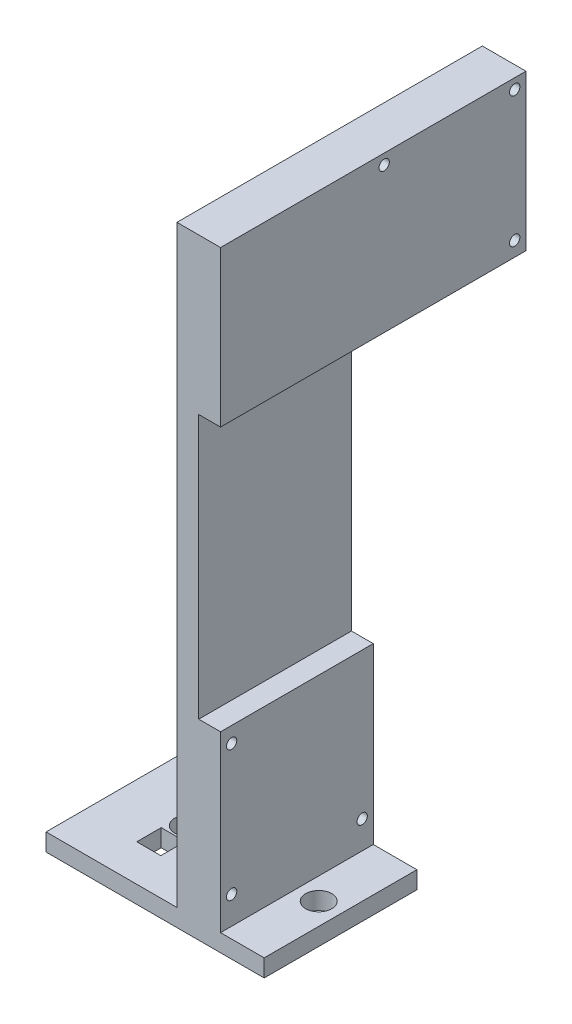
ISO-10303-21;
HEADER;
FILE_DESCRIPTION(('STEP AP214'),'2;1');
FILE_NAME('part.step','',(''),(''),'','','');
FILE_SCHEMA(('AUTOMOTIVE_DESIGN { 1 0 10303 214 1 1 1 1 }'));
ENDSEC;
DATA;
#1=APPLICATION_CONTEXT('core data for automotive mechanical design processes');
#2=APPLICATION_PROTOCOL_DEFINITION('international standard','automotive_design',2000,#1);
#3=PRODUCT_CONTEXT('',#1,'mechanical');
#4=PRODUCT('Part','Part','',(#3));
#5=PRODUCT_RELATED_PRODUCT_CATEGORY('part','',(#4));
#6=PRODUCT_DEFINITION_FORMATION('','',#4);
#7=PRODUCT_DEFINITION_CONTEXT('part definition',#1,'design');
#8=PRODUCT_DEFINITION('design','',#6,#7);
#9=PRODUCT_DEFINITION_SHAPE('','',#8);
#10=(LENGTH_UNIT() NAMED_UNIT(*) SI_UNIT(.MILLI.,.METRE.));
#11=(NAMED_UNIT(*) PLANE_ANGLE_UNIT() SI_UNIT($,.RADIAN.));
#12=(NAMED_UNIT(*) SI_UNIT($,.STERADIAN.) SOLID_ANGLE_UNIT());
#13=UNCERTAINTY_MEASURE_WITH_UNIT(LENGTH_MEASURE(1.E-05),#10,'distance_accuracy_value','');
#14=(GEOMETRIC_REPRESENTATION_CONTEXT(3) GLOBAL_UNCERTAINTY_ASSIGNED_CONTEXT((#13)) GLOBAL_UNIT_ASSIGNED_CONTEXT((#10,
#11,#12)) REPRESENTATION_CONTEXT('',''));
#15=CARTESIAN_POINT('',(0.,0.,0.));
#16=DIRECTION('',(0.,0.,1.));
#17=DIRECTION('',(1.,0.,0.));
#18=AXIS2_PLACEMENT_3D('',#15,#16,#17);
#19=CARTESIAN_POINT('',(6.35,172.72,22.225));
#20=DIRECTION('',(-1.,0.,0.));
#21=DIRECTION('',(0.,0.,1.));
#22=AXIS2_PLACEMENT_3D('',#19,#20,#21);
#23=PLANE('',#22);
#24=CARTESIAN_POINT('',(6.35,131.72,-63.4));
#25=DIRECTION('',(1.,0.,0.));
#26=DIRECTION('',(0.,0.,-1.));
#27=AXIS2_PLACEMENT_3D('',#24,#25,#26);
#28=CIRCLE('',#27,1.5);
#29=CARTESIAN_POINT('',(6.35,131.72,-64.9));
#30=VERTEX_POINT('',#29);
#31=EDGE_CURVE('E188',#30,#30,#28,.T.);
#32=ORIENTED_EDGE('',*,*,#31,.F.);
#33=EDGE_LOOP('',(#32));
#34=FACE_BOUND('',#33,.T.);
#35=CARTESIAN_POINT('',(6.35,169.72,-63.4));
#36=DIRECTION('',(1.,0.,0.));
#37=DIRECTION('',(0.,0.,-1.));
#38=AXIS2_PLACEMENT_3D('',#35,#36,#37);
#39=CIRCLE('',#38,1.5);
#40=CARTESIAN_POINT('',(6.35,169.72,-64.9));
#41=VERTEX_POINT('',#40);
#42=EDGE_CURVE('E185',#41,#41,#39,.T.);
#43=ORIENTED_EDGE('',*,*,#42,.F.);
#44=EDGE_LOOP('',(#43));
#45=FACE_BOUND('',#44,.T.);
#46=CARTESIAN_POINT('',(6.35,169.72,-25.4));
#47=DIRECTION('',(1.,0.,0.));
#48=DIRECTION('',(0.,0.,-1.));
#49=AXIS2_PLACEMENT_3D('',#46,#47,#48);
#50=CIRCLE('',#49,1.5);
#51=CARTESIAN_POINT('',(6.35,169.72,-26.9));
#52=VERTEX_POINT('',#51);
#53=EDGE_CURVE('E181',#52,#52,#50,.T.);
#54=ORIENTED_EDGE('',*,*,#53,.F.);
#55=EDGE_LOOP('',(#54));
#56=FACE_BOUND('',#55,.T.);
#57=DIRECTION('',(0.,-1.,0.));
#58=VECTOR('',#57,1.);
#59=CARTESIAN_POINT('',(6.35,172.72,22.225));
#60=LINE('',#59,#58);
#61=CARTESIAN_POINT('',(6.35,172.72,22.225));
#62=VERTEX_POINT('',#61);
#63=CARTESIAN_POINT('',(6.35,127.453317587513,22.225));
#64=VERTEX_POINT('',#63);
#65=EDGE_CURVE('E314',#62,#64,#60,.T.);
#66=ORIENTED_EDGE('',*,*,#65,.T.);
#67=DIRECTION('',(0.,0.,1.));
#68=VECTOR('',#67,1.);
#69=CARTESIAN_POINT('',(6.35,127.453317587513,-66.675));
#70=LINE('',#69,#68);
#71=CARTESIAN_POINT('',(6.35,127.453317587513,-66.675));
#72=VERTEX_POINT('',#71);
#73=EDGE_CURVE('E207',#72,#64,#70,.T.);
#74=ORIENTED_EDGE('',*,*,#73,.F.);
#75=DIRECTION('',(0.,-1.,0.));
#76=VECTOR('',#75,1.);
#77=CARTESIAN_POINT('',(6.35,127.453317587513,-66.675));
#78=LINE('',#77,#76);
#79=CARTESIAN_POINT('',(6.35,172.72,-66.675));
#80=VERTEX_POINT('',#79);
#81=EDGE_CURVE('E191',#80,#72,#78,.T.);
#82=ORIENTED_EDGE('',*,*,#81,.F.);
#83=DIRECTION('',(0.,0.,-1.));
#84=VECTOR('',#83,1.);
#85=CARTESIAN_POINT('',(6.35,172.72,22.225));
#86=LINE('',#85,#84);
#87=EDGE_CURVE('E303',#62,#80,#86,.T.);
#88=ORIENTED_EDGE('',*,*,#87,.F.);
#89=EDGE_LOOP('',(#66,#74,#82,#88));
#90=FACE_BOUND('',#89,.T.);
#91=ADVANCED_FACE('F33',(#34,#45,#56,#90),#23,.F.);
#92=CARTESIAN_POINT('',(-6.35,172.72,-22.225));
#93=DIRECTION('',(0.,0.,1.));
#94=DIRECTION('',(1.,0.,0.));
#95=AXIS2_PLACEMENT_3D('',#92,#93,#94);
#96=PLANE('',#95);
#97=DIRECTION('',(0.,1.,0.));
#98=VECTOR('',#97,1.);
#99=CARTESIAN_POINT('',(0.,50.6407677589493,-22.225));
#100=LINE('',#99,#98);
#101=CARTESIAN_POINT('',(0.,50.6407677589493,-22.225));
#102=VERTEX_POINT('',#101);
#103=CARTESIAN_POINT('',(0.,127.453317587513,-22.225));
#104=VERTEX_POINT('',#103);
#105=EDGE_CURVE('E162',#102,#104,#100,.T.);
#106=ORIENTED_EDGE('',*,*,#105,.F.);
#107=DIRECTION('',(1.,0.,0.));
#108=VECTOR('',#107,1.);
#109=CARTESIAN_POINT('',(0.,50.6407677589493,-22.225));
#110=LINE('',#109,#108);
#111=CARTESIAN_POINT('',(6.35,50.6407677589493,-22.225));
#112=VERTEX_POINT('',#111);
#113=EDGE_CURVE('E159',#102,#112,#110,.T.);
#114=ORIENTED_EDGE('',*,*,#113,.T.);
#115=DIRECTION('',(0.,-1.,0.));
#116=VECTOR('',#115,1.);
#117=CARTESIAN_POINT('',(6.35,172.72,-22.225));
#118=LINE('',#117,#116);
#119=CARTESIAN_POINT('',(6.35,0.,-22.225));
#120=VERTEX_POINT('',#119);
#121=EDGE_CURVE('E11',#112,#120,#118,.T.);
#122=ORIENTED_EDGE('',*,*,#121,.T.);
#123=DIRECTION('',(1.,0.,0.));
#124=VECTOR('',#123,1.);
#125=CARTESIAN_POINT('',(-44.45,0.,-22.225));
#126=LINE('',#125,#124);
#127=CARTESIAN_POINT('',(19.05,0.,-22.225));
#128=VERTEX_POINT('',#127);
#129=EDGE_CURVE('E265',#120,#128,#126,.T.);
#130=ORIENTED_EDGE('',*,*,#129,.T.);
#131=DIRECTION('',(0.,1.,0.));
#132=VECTOR('',#131,1.);
#133=CARTESIAN_POINT('',(19.05,-5.08,-22.225));
#134=LINE('',#133,#132);
#135=CARTESIAN_POINT('',(19.05,-5.08,-22.225));
#136=VERTEX_POINT('',#135);
#137=EDGE_CURVE('E278',#136,#128,#134,.T.);
#138=ORIENTED_EDGE('',*,*,#137,.F.);
#139=DIRECTION('',(1.,0.,0.));
#140=VECTOR('',#139,1.);
#141=CARTESIAN_POINT('',(-44.45,-5.08,-22.225));
#142=LINE('',#141,#140);
#143=CARTESIAN_POINT('',(-44.45,-5.08,-22.225));
#144=VERTEX_POINT('',#143);
#145=EDGE_CURVE('E255',#144,#136,#142,.T.);
#146=ORIENTED_EDGE('',*,*,#145,.F.);
#147=DIRECTION('',(0.,1.,0.));
#148=VECTOR('',#147,1.);
#149=CARTESIAN_POINT('',(-44.45,-5.08,-22.225));
#150=LINE('',#149,#148);
#151=CARTESIAN_POINT('',(-44.45,0.,-22.225));
#152=VERTEX_POINT('',#151);
#153=EDGE_CURVE('E281',#144,#152,#150,.T.);
#154=ORIENTED_EDGE('',*,*,#153,.T.);
#155=CARTESIAN_POINT('',(-6.34999999999999,0.,-22.225));
#156=VERTEX_POINT('',#155);
#157=EDGE_CURVE('E266',#152,#156,#126,.T.);
#158=ORIENTED_EDGE('',*,*,#157,.T.);
#159=DIRECTION('',(0.,-1.,0.));
#160=VECTOR('',#159,1.);
#161=CARTESIAN_POINT('',(-6.35,172.72,-22.225));
#162=LINE('',#161,#160);
#163=CARTESIAN_POINT('',(-6.35,127.453317587513,-22.225));
#164=VERTEX_POINT('',#163);
#165=EDGE_CURVE('E42',#164,#156,#162,.T.);
#166=ORIENTED_EDGE('',*,*,#165,.F.);
#167=DIRECTION('',(-1.,0.,0.));
#168=VECTOR('',#167,1.);
#169=CARTESIAN_POINT('',(6.35,127.453317587513,-22.225));
#170=LINE('',#169,#168);
#171=EDGE_CURVE('E195',#104,#164,#170,.T.);
#172=ORIENTED_EDGE('',*,*,#171,.F.);
#173=EDGE_LOOP('',(#106,#114,#122,#130,#138,#146,#154,#158,#166,#172));
#174=FACE_BOUND('',#173,.T.);
#175=ADVANCED_FACE('F346',(#174),#96,.F.);
#176=CARTESIAN_POINT('',(6.35,46.079994,19.0000001));
#177=DIRECTION('',(1.,0.,0.));
#178=DIRECTION('',(0.,0.,-1.));
#179=AXIS2_PLACEMENT_3D('',#176,#177,#178);
#180=CIRCLE('',#179,1.5);
#181=CARTESIAN_POINT('',(6.35,46.079994,17.5000001));
#182=VERTEX_POINT('',#181);
#183=EDGE_CURVE('E284',#182,#182,#180,.T.);
#184=ORIENTED_EDGE('',*,*,#183,.F.);
#185=EDGE_LOOP('',(#184));
#186=FACE_BOUND('',#185,.T.);
#187=CARTESIAN_POINT('',(6.35,8.079994,-19.));
#188=DIRECTION('',(1.,0.,0.));
#189=DIRECTION('',(0.,0.,-1.));
#190=AXIS2_PLACEMENT_3D('',#187,#188,#189);
#191=CIRCLE('',#190,1.5);
#192=CARTESIAN_POINT('',(6.35,8.079994,-20.5));
#193=VERTEX_POINT('',#192);
#194=EDGE_CURVE('E289',#193,#193,#191,.T.);
#195=ORIENTED_EDGE('',*,*,#194,.F.);
#196=EDGE_LOOP('',(#195));
#197=FACE_BOUND('',#196,.T.);
#198=CARTESIAN_POINT('',(6.35,8.079994,19.0000001));
#199=DIRECTION('',(1.,0.,0.));
#200=DIRECTION('',(0.,0.,-1.));
#201=AXIS2_PLACEMENT_3D('',#198,#199,#200);
#202=CIRCLE('',#201,1.5);
#203=CARTESIAN_POINT('',(6.35,8.079994,17.5000001));
#204=VERTEX_POINT('',#203);
#205=EDGE_CURVE('E288',#204,#204,#202,.T.);
#206=ORIENTED_EDGE('',*,*,#205,.F.);
#207=EDGE_LOOP('',(#206));
#208=FACE_BOUND('',#207,.T.);
#209=ORIENTED_EDGE('',*,*,#121,.F.);
#210=DIRECTION('',(0.,0.,-1.));
#211=VECTOR('',#210,1.);
#212=CARTESIAN_POINT('',(6.35,50.6407677589493,22.225));
#213=LINE('',#212,#211);
#214=CARTESIAN_POINT('',(6.35,50.6407677589493,22.225));
#215=VERTEX_POINT('',#214);
#216=EDGE_CURVE('E169',#215,#112,#213,.T.);
#217=ORIENTED_EDGE('',*,*,#216,.F.);
#218=CARTESIAN_POINT('',(6.35,0.,22.225));
#219=VERTEX_POINT('',#218);
#220=EDGE_CURVE('E174',#215,#219,#60,.T.);
#221=ORIENTED_EDGE('',*,*,#220,.T.);
#222=DIRECTION('',(0.,0.,-1.));
#223=VECTOR('',#222,1.);
#224=CARTESIAN_POINT('',(6.35,0.,22.225));
#225=LINE('',#224,#223);
#226=EDGE_CURVE('E300',#219,#120,#225,.T.);
#227=ORIENTED_EDGE('',*,*,#226,.T.);
#228=EDGE_LOOP('',(#209,#217,#221,#227));
#229=FACE_BOUND('',#228,.T.);
#230=ADVANCED_FACE('F35',(#186,#197,#208,#229),#23,.F.);
#231=CARTESIAN_POINT('',(-6.35,172.72,22.225));
#232=DIRECTION('',(1.,0.,0.));
#233=DIRECTION('',(0.,0.,-1.));
#234=AXIS2_PLACEMENT_3D('',#231,#232,#233);
#235=PLANE('',#234);
#236=CARTESIAN_POINT('',(-6.34999999999999,169.72,-25.4));
#237=DIRECTION('',(1.,0.,0.));
#238=DIRECTION('',(0.,0.,-1.));
#239=AXIS2_PLACEMENT_3D('',#236,#237,#238);
#240=CIRCLE('',#239,1.5);
#241=CARTESIAN_POINT('',(-6.34999999999999,169.72,-26.9));
#242=VERTEX_POINT('',#241);
#243=EDGE_CURVE('E37',#242,#242,#240,.T.);
#244=ORIENTED_EDGE('',*,*,#243,.T.);
#245=EDGE_LOOP('',(#244));
#246=FACE_BOUND('',#245,.T.);
#247=CARTESIAN_POINT('',(-6.34999999999999,169.72,-63.4));
#248=DIRECTION('',(1.,0.,0.));
#249=DIRECTION('',(0.,0.,-1.));
#250=AXIS2_PLACEMENT_3D('',#247,#248,#249);
#251=CIRCLE('',#250,1.5);
#252=CARTESIAN_POINT('',(-6.34999999999999,169.72,-64.9));
#253=VERTEX_POINT('',#252);
#254=EDGE_CURVE('E322',#253,#253,#251,.T.);
#255=ORIENTED_EDGE('',*,*,#254,.T.);
#256=EDGE_LOOP('',(#255));
#257=FACE_BOUND('',#256,.T.);
#258=CARTESIAN_POINT('',(-6.34999999999999,131.72,-63.4));
#259=DIRECTION('',(1.,0.,0.));
#260=DIRECTION('',(0.,0.,-1.));
#261=AXIS2_PLACEMENT_3D('',#258,#259,#260);
#262=CIRCLE('',#261,1.5);
#263=CARTESIAN_POINT('',(-6.34999999999999,131.72,-64.9));
#264=VERTEX_POINT('',#263);
#265=EDGE_CURVE('E184',#264,#264,#262,.T.);
#266=ORIENTED_EDGE('',*,*,#265,.T.);
#267=EDGE_LOOP('',(#266));
#268=FACE_BOUND('',#267,.T.);
#269=CARTESIAN_POINT('',(-6.35,46.079994,19.0000001));
#270=DIRECTION('',(1.,0.,0.));
#271=DIRECTION('',(0.,0.,-1.));
#272=AXIS2_PLACEMENT_3D('',#269,#270,#271);
#273=CIRCLE('',#272,1.5);
#274=CARTESIAN_POINT('',(-6.35,46.079994,17.5000001));
#275=VERTEX_POINT('',#274);
#276=EDGE_CURVE('E292',#275,#275,#273,.T.);
#277=ORIENTED_EDGE('',*,*,#276,.T.);
#278=EDGE_LOOP('',(#277));
#279=FACE_BOUND('',#278,.T.);
#280=CARTESIAN_POINT('',(-6.35,8.079994,-19.));
#281=DIRECTION('',(1.,0.,0.));
#282=DIRECTION('',(0.,0.,-1.));
#283=AXIS2_PLACEMENT_3D('',#280,#281,#282);
#284=CIRCLE('',#283,1.5);
#285=CARTESIAN_POINT('',(-6.35,8.079994,-20.5));
#286=VERTEX_POINT('',#285);
#287=EDGE_CURVE('E285',#286,#286,#284,.T.);
#288=ORIENTED_EDGE('',*,*,#287,.T.);
#289=EDGE_LOOP('',(#288));
#290=FACE_BOUND('',#289,.T.);
#291=CARTESIAN_POINT('',(-6.35,8.079994,19.0000001));
#292=DIRECTION('',(1.,0.,0.));
#293=DIRECTION('',(0.,0.,-1.));
#294=AXIS2_PLACEMENT_3D('',#291,#292,#293);
#295=CIRCLE('',#294,1.5);
#296=CARTESIAN_POINT('',(-6.35,8.079994,17.5000001));
#297=VERTEX_POINT('',#296);
#298=EDGE_CURVE('E297',#297,#297,#295,.T.);
#299=ORIENTED_EDGE('',*,*,#298,.T.);
#300=EDGE_LOOP('',(#299));
#301=FACE_BOUND('',#300,.T.);
#302=DIRECTION('',(0.,0.,1.));
#303=VECTOR('',#302,1.);
#304=CARTESIAN_POINT('',(-6.35,0.,22.225));
#305=LINE('',#304,#303);
#306=CARTESIAN_POINT('',(-6.35,0.,22.225));
#307=VERTEX_POINT('',#306);
#308=EDGE_CURVE('E306',#156,#307,#305,.T.);
#309=ORIENTED_EDGE('',*,*,#308,.T.);
#310=DIRECTION('',(0.,-1.,0.));
#311=VECTOR('',#310,1.);
#312=CARTESIAN_POINT('',(-6.35,172.72,22.225));
#313=LINE('',#312,#311);
#314=CARTESIAN_POINT('',(-6.35,172.72,22.225));
#315=VERTEX_POINT('',#314);
#316=EDGE_CURVE('E317',#315,#307,#313,.T.);
#317=ORIENTED_EDGE('',*,*,#316,.F.);
#318=DIRECTION('',(0.,0.,1.));
#319=VECTOR('',#318,1.);
#320=CARTESIAN_POINT('',(-6.35,172.72,22.225));
#321=LINE('',#320,#319);
#322=CARTESIAN_POINT('',(-6.35,172.72,-66.675));
#323=VERTEX_POINT('',#322);
#324=EDGE_CURVE('E305',#323,#315,#321,.T.);
#325=ORIENTED_EDGE('',*,*,#324,.F.);
#326=DIRECTION('',(0.,1.,0.));
#327=VECTOR('',#326,1.);
#328=CARTESIAN_POINT('',(-6.35,127.453317587513,-66.675));
#329=LINE('',#328,#327);
#330=CARTESIAN_POINT('',(-6.35,127.453317587513,-66.675));
#331=VERTEX_POINT('',#330);
#332=EDGE_CURVE('E197',#331,#323,#329,.T.);
#333=ORIENTED_EDGE('',*,*,#332,.F.);
#334=DIRECTION('',(0.,0.,1.));
#335=VECTOR('',#334,1.);
#336=CARTESIAN_POINT('',(-6.35,127.453317587513,-66.675));
#337=LINE('',#336,#335);
#338=EDGE_CURVE('E203',#331,#164,#337,.T.);
#339=ORIENTED_EDGE('',*,*,#338,.T.);
#340=ORIENTED_EDGE('',*,*,#165,.T.);
#341=EDGE_LOOP('',(#309,#317,#325,#333,#339,#340));
#342=FACE_BOUND('',#341,.T.);
#343=ADVANCED_FACE('F329',(#246,#257,#268,#279,#290,#301,#342),#235,.F.);
#344=CARTESIAN_POINT('',(-6.35,172.72,22.225));
#345=DIRECTION('',(0.,0.,-1.));
#346=DIRECTION('',(-1.,0.,0.));
#347=AXIS2_PLACEMENT_3D('',#344,#345,#346);
#348=PLANE('',#347);
#349=DIRECTION('',(0.,-1.,0.));
#350=VECTOR('',#349,1.);
#351=CARTESIAN_POINT('',(0.,50.6407677589493,22.225));
#352=LINE('',#351,#350);
#353=CARTESIAN_POINT('',(0.,127.453317587513,22.225));
#354=VERTEX_POINT('',#353);
#355=CARTESIAN_POINT('',(0.,50.6407677589493,22.225));
#356=VERTEX_POINT('',#355);
#357=EDGE_CURVE('E163',#354,#356,#352,.T.);
#358=ORIENTED_EDGE('',*,*,#357,.F.);
#359=DIRECTION('',(1.,0.,0.));
#360=VECTOR('',#359,1.);
#361=CARTESIAN_POINT('',(0.,127.453317587513,22.225));
#362=LINE('',#361,#360);
#363=EDGE_CURVE('E176',#354,#64,#362,.T.);
#364=ORIENTED_EDGE('',*,*,#363,.T.);
#365=ORIENTED_EDGE('',*,*,#65,.F.);
#366=DIRECTION('',(1.,0.,0.));
#367=VECTOR('',#366,1.);
#368=CARTESIAN_POINT('',(-6.35,172.72,22.225));
#369=LINE('',#368,#367);
#370=EDGE_CURVE('E308',#315,#62,#369,.T.);
#371=ORIENTED_EDGE('',*,*,#370,.F.);
#372=ORIENTED_EDGE('',*,*,#316,.T.);
#373=DIRECTION('',(-1.,0.,0.));
#374=VECTOR('',#373,1.);
#375=CARTESIAN_POINT('',(-44.45,0.,22.225));
#376=LINE('',#375,#374);
#377=CARTESIAN_POINT('',(-44.45,0.,22.225));
#378=VERTEX_POINT('',#377);
#379=EDGE_CURVE('E271',#307,#378,#376,.T.);
#380=ORIENTED_EDGE('',*,*,#379,.T.);
#381=DIRECTION('',(0.,1.,0.));
#382=VECTOR('',#381,1.);
#383=CARTESIAN_POINT('',(-44.45,-5.08,22.225));
#384=LINE('',#383,#382);
#385=CARTESIAN_POINT('',(-44.45,-5.08,22.225));
#386=VERTEX_POINT('',#385);
#387=EDGE_CURVE('E262',#386,#378,#384,.T.);
#388=ORIENTED_EDGE('',*,*,#387,.F.);
#389=DIRECTION('',(-1.,0.,0.));
#390=VECTOR('',#389,1.);
#391=CARTESIAN_POINT('',(-44.45,-5.08,22.225));
#392=LINE('',#391,#390);
#393=CARTESIAN_POINT('',(19.05,-5.08,22.225));
#394=VERTEX_POINT('',#393);
#395=EDGE_CURVE('E260',#394,#386,#392,.T.);
#396=ORIENTED_EDGE('',*,*,#395,.F.);
#397=DIRECTION('',(0.,1.,0.));
#398=VECTOR('',#397,1.);
#399=CARTESIAN_POINT('',(19.05,-5.08,22.225));
#400=LINE('',#399,#398);
#401=CARTESIAN_POINT('',(19.05,0.,22.225));
#402=VERTEX_POINT('',#401);
#403=EDGE_CURVE('E275',#394,#402,#400,.T.);
#404=ORIENTED_EDGE('',*,*,#403,.T.);
#405=EDGE_CURVE('E256',#402,#219,#376,.T.);
#406=ORIENTED_EDGE('',*,*,#405,.T.);
#407=ORIENTED_EDGE('',*,*,#220,.F.);
#408=DIRECTION('',(1.,0.,0.));
#409=VECTOR('',#408,1.);
#410=CARTESIAN_POINT('',(0.,50.6407677589493,22.225));
#411=LINE('',#410,#409);
#412=EDGE_CURVE('E156',#356,#215,#411,.T.);
#413=ORIENTED_EDGE('',*,*,#412,.F.);
#414=EDGE_LOOP('',(#358,#364,#365,#371,#372,#380,#388,#396,#404,#406,#407,#413));
#415=FACE_BOUND('',#414,.T.);
#416=ADVANCED_FACE('F172',(#415),#348,.F.);
#417=CARTESIAN_POINT('',(0.,172.72,0.));
#418=DIRECTION('',(0.,-1.,0.));
#419=DIRECTION('',(0.,0.,-1.));
#420=AXIS2_PLACEMENT_3D('',#417,#418,#419);
#421=PLANE('',#420);
#422=ORIENTED_EDGE('',*,*,#87,.T.);
#423=DIRECTION('',(1.,0.,0.));
#424=VECTOR('',#423,1.);
#425=CARTESIAN_POINT('',(6.35,172.72,-66.675));
#426=LINE('',#425,#424);
#427=EDGE_CURVE('E200',#323,#80,#426,.T.);
#428=ORIENTED_EDGE('',*,*,#427,.F.);
#429=ORIENTED_EDGE('',*,*,#324,.T.);
#430=ORIENTED_EDGE('',*,*,#370,.T.);
#431=EDGE_LOOP('',(#422,#428,#429,#430));
#432=FACE_BOUND('',#431,.T.);
#433=ADVANCED_FACE('F398',(#432),#421,.F.);
#434=CARTESIAN_POINT('',(-6.35,8.079994,19.0000001));
#435=DIRECTION('',(1.,0.,0.));
#436=DIRECTION('',(0.,0.,-1.));
#437=AXIS2_PLACEMENT_3D('',#434,#435,#436);
#438=CYLINDRICAL_SURFACE('',#437,1.5);
#439=ORIENTED_EDGE('',*,*,#298,.F.);
#440=EDGE_LOOP('',(#439));
#441=FACE_BOUND('',#440,.T.);
#442=ORIENTED_EDGE('',*,*,#205,.T.);
#443=EDGE_LOOP('',(#442));
#444=FACE_BOUND('',#443,.T.);
#445=ADVANCED_FACE('F456',(#441,#444),#438,.F.);
#446=CARTESIAN_POINT('',(-6.35,8.079994,-19.));
#447=DIRECTION('',(1.,0.,0.));
#448=DIRECTION('',(0.,0.,-1.));
#449=AXIS2_PLACEMENT_3D('',#446,#447,#448);
#450=CYLINDRICAL_SURFACE('',#449,1.5);
#451=ORIENTED_EDGE('',*,*,#287,.F.);
#452=EDGE_LOOP('',(#451));
#453=FACE_BOUND('',#452,.T.);
#454=ORIENTED_EDGE('',*,*,#194,.T.);
#455=EDGE_LOOP('',(#454));
#456=FACE_BOUND('',#455,.T.);
#457=ADVANCED_FACE('F453',(#453,#456),#450,.F.);
#458=CARTESIAN_POINT('',(-6.35,46.079994,19.0000001));
#459=DIRECTION('',(1.,0.,0.));
#460=DIRECTION('',(0.,0.,-1.));
#461=AXIS2_PLACEMENT_3D('',#458,#459,#460);
#462=CYLINDRICAL_SURFACE('',#461,1.5);
#463=ORIENTED_EDGE('',*,*,#276,.F.);
#464=EDGE_LOOP('',(#463));
#465=FACE_BOUND('',#464,.T.);
#466=ORIENTED_EDGE('',*,*,#183,.T.);
#467=EDGE_LOOP('',(#466));
#468=FACE_BOUND('',#467,.T.);
#469=ADVANCED_FACE('F447',(#465,#468),#462,.F.);
#470=CARTESIAN_POINT('',(0.,0.,0.));
#471=DIRECTION('',(0.,1.,0.));
#472=DIRECTION('',(0.,0.,1.));
#473=AXIS2_PLACEMENT_3D('',#470,#471,#472);
#474=PLANE('',#473);
#475=CARTESIAN_POINT('',(12.7,0.,0.));
#476=DIRECTION('',(0.,1.,0.));
#477=DIRECTION('',(0.,0.,1.));
#478=AXIS2_PLACEMENT_3D('',#475,#476,#477);
#479=CIRCLE('',#478,3.81);
#480=CARTESIAN_POINT('',(12.7,0.,3.81));
#481=VERTEX_POINT('',#480);
#482=EDGE_CURVE('E244',#481,#481,#479,.T.);
#483=ORIENTED_EDGE('',*,*,#482,.F.);
#484=EDGE_LOOP('',(#483));
#485=FACE_BOUND('',#484,.T.);
#486=ORIENTED_EDGE('',*,*,#226,.F.);
#487=ORIENTED_EDGE('',*,*,#405,.F.);
#488=DIRECTION('',(0.,0.,1.));
#489=VECTOR('',#488,1.);
#490=CARTESIAN_POINT('',(19.05,0.,-22.225));
#491=LINE('',#490,#489);
#492=EDGE_CURVE('E269',#128,#402,#491,.T.);
#493=ORIENTED_EDGE('',*,*,#492,.F.);
#494=ORIENTED_EDGE('',*,*,#129,.F.);
#495=EDGE_LOOP('',(#486,#487,#493,#494));
#496=FACE_BOUND('',#495,.T.);
#497=ADVANCED_FACE('F373',(#485,#496),#474,.T.);
#498=DIRECTION('',(0.,0.,1.));
#499=VECTOR('',#498,1.);
#500=CARTESIAN_POINT('',(-28.7592801227277,0.,11.5109985957815));
#501=LINE('',#500,#499);
#502=CARTESIAN_POINT('',(-28.7592801227277,0.,4.38967509518307));
#503=VERTEX_POINT('',#502);
#504=CARTESIAN_POINT('',(-28.7592801227277,0.,11.5109985957815));
#505=VERTEX_POINT('',#504);
#506=EDGE_CURVE('E58',#503,#505,#501,.T.);
#507=ORIENTED_EDGE('',*,*,#506,.F.);
#508=DIRECTION('',(-1.,0.,0.));
#509=VECTOR('',#508,1.);
#510=CARTESIAN_POINT('',(-28.7592801227277,0.,4.38967509518307));
#511=LINE('',#510,#509);
#512=CARTESIAN_POINT('',(-21.7603934983508,0.,4.38967509518307));
#513=VERTEX_POINT('',#512);
#514=EDGE_CURVE('E213',#513,#503,#511,.T.);
#515=ORIENTED_EDGE('',*,*,#514,.F.);
#516=DIRECTION('',(0.,0.,-1.));
#517=VECTOR('',#516,1.);
#518=CARTESIAN_POINT('',(-21.7603934983508,0.,11.5109985957815));
#519=LINE('',#518,#517);
#520=CARTESIAN_POINT('',(-21.7603934983508,0.,11.5109985957815));
#521=VERTEX_POINT('',#520);
#522=EDGE_CURVE('E227',#521,#513,#519,.T.);
#523=ORIENTED_EDGE('',*,*,#522,.F.);
#524=DIRECTION('',(1.,0.,0.));
#525=VECTOR('',#524,1.);
#526=CARTESIAN_POINT('',(-28.7592801227277,0.,11.5109985957815));
#527=LINE('',#526,#525);
#528=EDGE_CURVE('E224',#505,#521,#527,.T.);
#529=ORIENTED_EDGE('',*,*,#528,.F.);
#530=EDGE_LOOP('',(#507,#515,#523,#529));
#531=FACE_BOUND('',#530,.T.);
#532=CARTESIAN_POINT('',(-25.4,0.,0.));
#533=DIRECTION('',(0.,1.,0.));
#534=DIRECTION('',(0.,0.,1.));
#535=AXIS2_PLACEMENT_3D('',#532,#533,#534);
#536=CIRCLE('',#535,3.81);
#537=CARTESIAN_POINT('',(-25.4,0.,3.81));
#538=VERTEX_POINT('',#537);
#539=EDGE_CURVE('E234',#538,#538,#536,.T.);
#540=ORIENTED_EDGE('',*,*,#539,.F.);
#541=EDGE_LOOP('',(#540));
#542=FACE_BOUND('',#541,.T.);
#543=ORIENTED_EDGE('',*,*,#308,.F.);
#544=ORIENTED_EDGE('',*,*,#157,.F.);
#545=DIRECTION('',(0.,0.,-1.));
#546=VECTOR('',#545,1.);
#547=CARTESIAN_POINT('',(-44.45,0.,-22.225));
#548=LINE('',#547,#546);
#549=EDGE_CURVE('E243',#378,#152,#548,.T.);
#550=ORIENTED_EDGE('',*,*,#549,.F.);
#551=ORIENTED_EDGE('',*,*,#379,.F.);
#552=EDGE_LOOP('',(#543,#544,#550,#551));
#553=FACE_BOUND('',#552,.T.);
#554=ADVANCED_FACE('F391',(#531,#542,#553),#474,.T.);
#555=CARTESIAN_POINT('',(-44.45,-5.08,-22.225));
#556=DIRECTION('',(1.,0.,0.));
#557=DIRECTION('',(0.,0.,-1.));
#558=AXIS2_PLACEMENT_3D('',#555,#556,#557);
#559=PLANE('',#558);
#560=ORIENTED_EDGE('',*,*,#549,.T.);
#561=ORIENTED_EDGE('',*,*,#153,.F.);
#562=DIRECTION('',(0.,0.,-1.));
#563=VECTOR('',#562,1.);
#564=CARTESIAN_POINT('',(-44.45,-5.08,-22.225));
#565=LINE('',#564,#563);
#566=EDGE_CURVE('E252',#386,#144,#565,.T.);
#567=ORIENTED_EDGE('',*,*,#566,.F.);
#568=ORIENTED_EDGE('',*,*,#387,.T.);
#569=EDGE_LOOP('',(#560,#561,#567,#568));
#570=FACE_BOUND('',#569,.T.);
#571=ADVANCED_FACE('F388',(#570),#559,.F.);
#572=CARTESIAN_POINT('',(19.05,-5.08,-22.225));
#573=DIRECTION('',(-1.,0.,0.));
#574=DIRECTION('',(0.,0.,1.));
#575=AXIS2_PLACEMENT_3D('',#572,#573,#574);
#576=PLANE('',#575);
#577=ORIENTED_EDGE('',*,*,#492,.T.);
#578=ORIENTED_EDGE('',*,*,#403,.F.);
#579=DIRECTION('',(0.,0.,1.));
#580=VECTOR('',#579,1.);
#581=CARTESIAN_POINT('',(19.05,-5.08,-22.225));
#582=LINE('',#581,#580);
#583=EDGE_CURVE('E258',#136,#394,#582,.T.);
#584=ORIENTED_EDGE('',*,*,#583,.F.);
#585=ORIENTED_EDGE('',*,*,#137,.T.);
#586=EDGE_LOOP('',(#577,#578,#584,#585));
#587=FACE_BOUND('',#586,.T.);
#588=ADVANCED_FACE('F377',(#587),#576,.F.);
#589=CARTESIAN_POINT('',(0.,-5.08,0.));
#590=DIRECTION('',(0.,1.,0.));
#591=DIRECTION('',(0.,0.,1.));
#592=AXIS2_PLACEMENT_3D('',#589,#590,#591);
#593=PLANE('',#592);
#594=DIRECTION('',(-1.,0.,0.));
#595=VECTOR('',#594,1.);
#596=CARTESIAN_POINT('',(-28.7592801227277,-5.08,4.38967509518307));
#597=LINE('',#596,#595);
#598=CARTESIAN_POINT('',(-21.7603934983508,-5.08,4.38967509518307));
#599=VERTEX_POINT('',#598);
#600=CARTESIAN_POINT('',(-28.7592801227277,-5.08,4.38967509518307));
#601=VERTEX_POINT('',#600);
#602=EDGE_CURVE('E219',#599,#601,#597,.T.);
#603=ORIENTED_EDGE('',*,*,#602,.T.);
#604=DIRECTION('',(0.,0.,1.));
#605=VECTOR('',#604,1.);
#606=CARTESIAN_POINT('',(-28.7592801227277,-5.08,11.5109985957815));
#607=LINE('',#606,#605);
#608=CARTESIAN_POINT('',(-28.7592801227277,-5.08,11.5109985957815));
#609=VERTEX_POINT('',#608);
#610=EDGE_CURVE('E209',#601,#609,#607,.T.);
#611=ORIENTED_EDGE('',*,*,#610,.T.);
#612=DIRECTION('',(1.,0.,0.));
#613=VECTOR('',#612,1.);
#614=CARTESIAN_POINT('',(-28.7592801227277,-5.08,11.5109985957815));
#615=LINE('',#614,#613);
#616=CARTESIAN_POINT('',(-21.7603934983508,-5.08,11.5109985957815));
#617=VERTEX_POINT('',#616);
#618=EDGE_CURVE('E212',#609,#617,#615,.T.);
#619=ORIENTED_EDGE('',*,*,#618,.T.);
#620=DIRECTION('',(0.,0.,-1.));
#621=VECTOR('',#620,1.);
#622=CARTESIAN_POINT('',(-21.7603934983508,-5.08,11.5109985957815));
#623=LINE('',#622,#621);
#624=EDGE_CURVE('E216',#617,#599,#623,.T.);
#625=ORIENTED_EDGE('',*,*,#624,.T.);
#626=EDGE_LOOP('',(#603,#611,#619,#625));
#627=FACE_BOUND('',#626,.T.);
#628=CARTESIAN_POINT('',(12.7,-5.08,0.));
#629=DIRECTION('',(0.,1.,0.));
#630=DIRECTION('',(0.,0.,1.));
#631=AXIS2_PLACEMENT_3D('',#628,#629,#630);
#632=CIRCLE('',#631,3.81);
#633=CARTESIAN_POINT('',(12.7,-5.08,3.81));
#634=VERTEX_POINT('',#633);
#635=EDGE_CURVE('E240',#634,#634,#632,.T.);
#636=ORIENTED_EDGE('',*,*,#635,.T.);
#637=EDGE_LOOP('',(#636));
#638=FACE_BOUND('',#637,.T.);
#639=CARTESIAN_POINT('',(-25.4,-5.08,0.));
#640=DIRECTION('',(0.,1.,0.));
#641=DIRECTION('',(0.,0.,1.));
#642=AXIS2_PLACEMENT_3D('',#639,#640,#641);
#643=CIRCLE('',#642,3.81);
#644=CARTESIAN_POINT('',(-25.4,-5.08,3.81));
#645=VERTEX_POINT('',#644);
#646=EDGE_CURVE('E247',#645,#645,#643,.T.);
#647=ORIENTED_EDGE('',*,*,#646,.T.);
#648=EDGE_LOOP('',(#647));
#649=FACE_BOUND('',#648,.T.);
#650=ORIENTED_EDGE('',*,*,#566,.T.);
#651=ORIENTED_EDGE('',*,*,#145,.T.);
#652=ORIENTED_EDGE('',*,*,#583,.T.);
#653=ORIENTED_EDGE('',*,*,#395,.T.);
#654=EDGE_LOOP('',(#650,#651,#652,#653));
#655=FACE_BOUND('',#654,.T.);
#656=ADVANCED_FACE('F383',(#627,#638,#649,#655),#593,.F.);
#657=CARTESIAN_POINT('',(-25.4,-5.08,0.));
#658=DIRECTION('',(0.,1.,0.));
#659=DIRECTION('',(0.,0.,1.));
#660=AXIS2_PLACEMENT_3D('',#657,#658,#659);
#661=CYLINDRICAL_SURFACE('',#660,3.81);
#662=ORIENTED_EDGE('',*,*,#646,.F.);
#663=EDGE_LOOP('',(#662));
#664=FACE_BOUND('',#663,.T.);
#665=ORIENTED_EDGE('',*,*,#539,.T.);
#666=EDGE_LOOP('',(#665));
#667=FACE_BOUND('',#666,.T.);
#668=ADVANCED_FACE('F437',(#664,#667),#661,.F.);
#669=CARTESIAN_POINT('',(12.7,-5.08,0.));
#670=DIRECTION('',(0.,1.,0.));
#671=DIRECTION('',(0.,0.,1.));
#672=AXIS2_PLACEMENT_3D('',#669,#670,#671);
#673=CYLINDRICAL_SURFACE('',#672,3.81);
#674=ORIENTED_EDGE('',*,*,#635,.F.);
#675=EDGE_LOOP('',(#674));
#676=FACE_BOUND('',#675,.T.);
#677=ORIENTED_EDGE('',*,*,#482,.T.);
#678=EDGE_LOOP('',(#677));
#679=FACE_BOUND('',#678,.T.);
#680=ADVANCED_FACE('F434',(#676,#679),#673,.F.);
#681=CARTESIAN_POINT('',(-28.7592801227277,-5.08,11.5109985957815));
#682=DIRECTION('',(-1.,0.,0.));
#683=DIRECTION('',(0.,0.,1.));
#684=AXIS2_PLACEMENT_3D('',#681,#682,#683);
#685=PLANE('',#684);
#686=ORIENTED_EDGE('',*,*,#506,.T.);
#687=DIRECTION('',(0.,1.,0.));
#688=VECTOR('',#687,1.);
#689=CARTESIAN_POINT('',(-28.7592801227277,-5.08,11.5109985957815));
#690=LINE('',#689,#688);
#691=EDGE_CURVE('E222',#609,#505,#690,.T.);
#692=ORIENTED_EDGE('',*,*,#691,.F.);
#693=ORIENTED_EDGE('',*,*,#610,.F.);
#694=DIRECTION('',(0.,1.,0.));
#695=VECTOR('',#694,1.);
#696=CARTESIAN_POINT('',(-28.7592801227277,-5.08,4.38967509518307));
#697=LINE('',#696,#695);
#698=EDGE_CURVE('E232',#601,#503,#697,.T.);
#699=ORIENTED_EDGE('',*,*,#698,.T.);
#700=EDGE_LOOP('',(#686,#692,#693,#699));
#701=FACE_BOUND('',#700,.T.);
#702=ADVANCED_FACE('F427',(#701),#685,.F.);
#703=CARTESIAN_POINT('',(-28.7592801227277,-5.08,4.38967509518307));
#704=DIRECTION('',(0.,0.,-1.));
#705=DIRECTION('',(-1.,0.,0.));
#706=AXIS2_PLACEMENT_3D('',#703,#704,#705);
#707=PLANE('',#706);
#708=ORIENTED_EDGE('',*,*,#514,.T.);
#709=ORIENTED_EDGE('',*,*,#698,.F.);
#710=ORIENTED_EDGE('',*,*,#602,.F.);
#711=DIRECTION('',(0.,1.,0.));
#712=VECTOR('',#711,1.);
#713=CARTESIAN_POINT('',(-21.7603934983508,-5.08,4.38967509518307));
#714=LINE('',#713,#712);
#715=EDGE_CURVE('E235',#599,#513,#714,.T.);
#716=ORIENTED_EDGE('',*,*,#715,.T.);
#717=EDGE_LOOP('',(#708,#709,#710,#716));
#718=FACE_BOUND('',#717,.T.);
#719=ADVANCED_FACE('F424',(#718),#707,.F.);
#720=CARTESIAN_POINT('',(-21.7603934983508,-5.08,11.5109985957815));
#721=DIRECTION('',(1.,0.,0.));
#722=DIRECTION('',(0.,0.,-1.));
#723=AXIS2_PLACEMENT_3D('',#720,#721,#722);
#724=PLANE('',#723);
#725=ORIENTED_EDGE('',*,*,#522,.T.);
#726=ORIENTED_EDGE('',*,*,#715,.F.);
#727=ORIENTED_EDGE('',*,*,#624,.F.);
#728=DIRECTION('',(0.,1.,0.));
#729=VECTOR('',#728,1.);
#730=CARTESIAN_POINT('',(-21.7603934983508,-5.08,11.5109985957815));
#731=LINE('',#730,#729);
#732=EDGE_CURVE('E237',#617,#521,#731,.T.);
#733=ORIENTED_EDGE('',*,*,#732,.T.);
#734=EDGE_LOOP('',(#725,#726,#727,#733));
#735=FACE_BOUND('',#734,.T.);
#736=ADVANCED_FACE('F419',(#735),#724,.F.);
#737=CARTESIAN_POINT('',(-28.7592801227277,-5.08,11.5109985957815));
#738=DIRECTION('',(0.,0.,1.));
#739=DIRECTION('',(1.,0.,0.));
#740=AXIS2_PLACEMENT_3D('',#737,#738,#739);
#741=PLANE('',#740);
#742=ORIENTED_EDGE('',*,*,#528,.T.);
#743=ORIENTED_EDGE('',*,*,#732,.F.);
#744=ORIENTED_EDGE('',*,*,#618,.F.);
#745=ORIENTED_EDGE('',*,*,#691,.T.);
#746=EDGE_LOOP('',(#742,#743,#744,#745));
#747=FACE_BOUND('',#746,.T.);
#748=ADVANCED_FACE('F412',(#747),#741,.F.);
#749=CARTESIAN_POINT('',(6.35,127.453317587513,-66.675));
#750=DIRECTION('',(0.,1.,0.));
#751=DIRECTION('',(0.,0.,1.));
#752=AXIS2_PLACEMENT_3D('',#749,#750,#751);
#753=PLANE('',#752);
#754=ORIENTED_EDGE('',*,*,#73,.T.);
#755=ORIENTED_EDGE('',*,*,#363,.F.);
#756=DIRECTION('',(0.,0.,1.));
#757=VECTOR('',#756,1.);
#758=CARTESIAN_POINT('',(0.,127.453317587513,22.225));
#759=LINE('',#758,#757);
#760=EDGE_CURVE('E50',#104,#354,#759,.T.);
#761=ORIENTED_EDGE('',*,*,#760,.F.);
#762=ORIENTED_EDGE('',*,*,#171,.T.);
#763=ORIENTED_EDGE('',*,*,#338,.F.);
#764=DIRECTION('',(-1.,0.,0.));
#765=VECTOR('',#764,1.);
#766=CARTESIAN_POINT('',(6.35,127.453317587513,-66.675));
#767=LINE('',#766,#765);
#768=EDGE_CURVE('E194',#72,#331,#767,.T.);
#769=ORIENTED_EDGE('',*,*,#768,.F.);
#770=EDGE_LOOP('',(#754,#755,#761,#762,#763,#769));
#771=FACE_BOUND('',#770,.T.);
#772=ADVANCED_FACE('F406',(#771),#753,.F.);
#773=CARTESIAN_POINT('',(0.,0.,-66.675));
#774=DIRECTION('',(0.,0.,1.));
#775=DIRECTION('',(1.,0.,0.));
#776=AXIS2_PLACEMENT_3D('',#773,#774,#775);
#777=PLANE('',#776);
#778=ORIENTED_EDGE('',*,*,#81,.T.);
#779=ORIENTED_EDGE('',*,*,#768,.T.);
#780=ORIENTED_EDGE('',*,*,#332,.T.);
#781=ORIENTED_EDGE('',*,*,#427,.T.);
#782=EDGE_LOOP('',(#778,#779,#780,#781));
#783=FACE_BOUND('',#782,.T.);
#784=ADVANCED_FACE('F402',(#783),#777,.F.);
#785=CARTESIAN_POINT('',(-44.45,131.72,-63.4));
#786=DIRECTION('',(1.,0.,0.));
#787=DIRECTION('',(0.,0.,-1.));
#788=AXIS2_PLACEMENT_3D('',#785,#786,#787);
#789=CYLINDRICAL_SURFACE('',#788,1.5);
#790=ORIENTED_EDGE('',*,*,#31,.T.);
#791=EDGE_LOOP('',(#790));
#792=FACE_BOUND('',#791,.T.);
#793=ORIENTED_EDGE('',*,*,#265,.F.);
#794=EDGE_LOOP('',(#793));
#795=FACE_BOUND('',#794,.T.);
#796=ADVANCED_FACE('F342',(#792,#795),#789,.F.);
#797=CARTESIAN_POINT('',(-44.45,169.72,-63.4));
#798=DIRECTION('',(1.,0.,0.));
#799=DIRECTION('',(0.,0.,-1.));
#800=AXIS2_PLACEMENT_3D('',#797,#798,#799);
#801=CYLINDRICAL_SURFACE('',#800,1.5);
#802=ORIENTED_EDGE('',*,*,#42,.T.);
#803=EDGE_LOOP('',(#802));
#804=FACE_BOUND('',#803,.T.);
#805=ORIENTED_EDGE('',*,*,#254,.F.);
#806=EDGE_LOOP('',(#805));
#807=FACE_BOUND('',#806,.T.);
#808=ADVANCED_FACE('F333',(#804,#807),#801,.F.);
#809=CARTESIAN_POINT('',(-44.45,169.72,-25.4));
#810=DIRECTION('',(1.,0.,0.));
#811=DIRECTION('',(0.,0.,-1.));
#812=AXIS2_PLACEMENT_3D('',#809,#810,#811);
#813=CYLINDRICAL_SURFACE('',#812,1.5);
#814=ORIENTED_EDGE('',*,*,#53,.T.);
#815=EDGE_LOOP('',(#814));
#816=FACE_BOUND('',#815,.T.);
#817=ORIENTED_EDGE('',*,*,#243,.F.);
#818=EDGE_LOOP('',(#817));
#819=FACE_BOUND('',#818,.T.);
#820=ADVANCED_FACE('F331',(#816,#819),#813,.F.);
#821=CARTESIAN_POINT('',(0.,50.6407677589493,22.225));
#822=DIRECTION('',(0.,-1.,0.));
#823=DIRECTION('',(0.,0.,-1.));
#824=AXIS2_PLACEMENT_3D('',#821,#822,#823);
#825=PLANE('',#824);
#826=ORIENTED_EDGE('',*,*,#216,.T.);
#827=ORIENTED_EDGE('',*,*,#113,.F.);
#828=DIRECTION('',(0.,0.,-1.));
#829=VECTOR('',#828,1.);
#830=CARTESIAN_POINT('',(0.,50.6407677589493,22.225));
#831=LINE('',#830,#829);
#832=EDGE_CURVE('E152',#356,#102,#831,.T.);
#833=ORIENTED_EDGE('',*,*,#832,.F.);
#834=ORIENTED_EDGE('',*,*,#412,.T.);
#835=EDGE_LOOP('',(#826,#827,#833,#834));
#836=FACE_BOUND('',#835,.T.);
#837=ADVANCED_FACE('F154',(#836),#825,.F.);
#838=CARTESIAN_POINT('',(0.,0.,0.));
#839=DIRECTION('',(-1.,0.,0.));
#840=DIRECTION('',(0.,0.,1.));
#841=AXIS2_PLACEMENT_3D('',#838,#839,#840);
#842=PLANE('',#841);
#843=ORIENTED_EDGE('',*,*,#357,.T.);
#844=ORIENTED_EDGE('',*,*,#832,.T.);
#845=ORIENTED_EDGE('',*,*,#105,.T.);
#846=ORIENTED_EDGE('',*,*,#760,.T.);
#847=EDGE_LOOP('',(#843,#844,#845,#846));
#848=FACE_BOUND('',#847,.T.);
#849=ADVANCED_FACE('F166',(#848),#842,.F.);
#850=CLOSED_SHELL('',(#91,#175,#230,#343,#416,#433,#445,#457,#469,#497,#554,#571,#588,#656,#668,
#680,#702,#719,#736,#748,#772,#784,#796,#808,#820,#837,#849));
#851=MANIFOLD_SOLID_BREP('B2',#850);
#852=ADVANCED_BREP_SHAPE_REPRESENTATION('',(#18,#851),#14);
#853=SHAPE_DEFINITION_REPRESENTATION(#9,#852);
ENDSEC;
END-ISO-10303-21;
